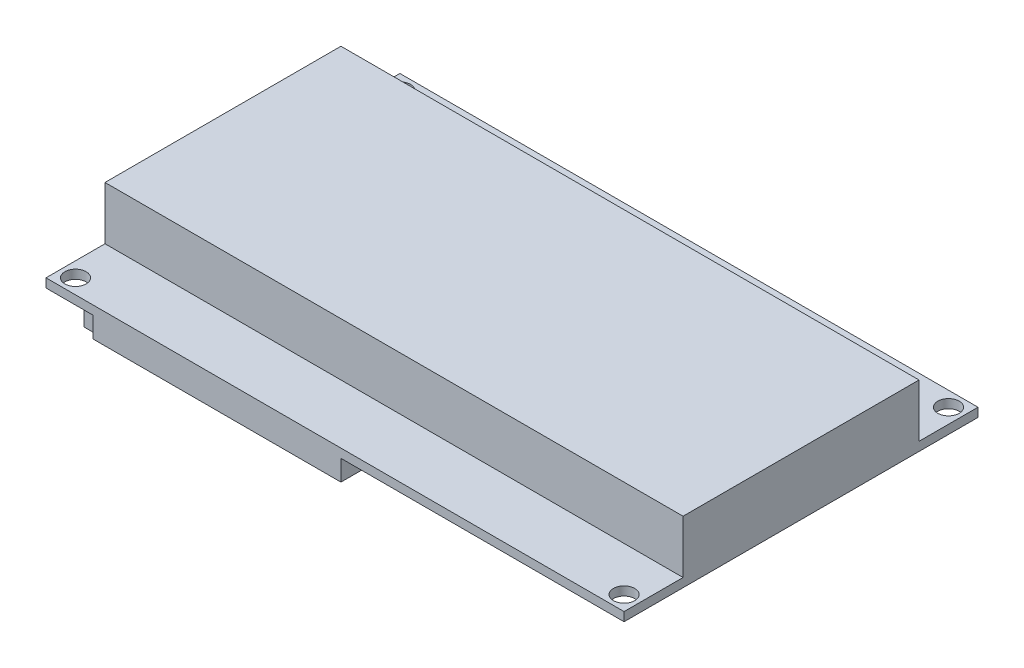
ISO-10303-21;
HEADER;
FILE_DESCRIPTION(('STEP AP214'),'2;1');
FILE_NAME('part.step','',(''),(''),'','','');
FILE_SCHEMA(('AUTOMOTIVE_DESIGN { 1 0 10303 214 1 1 1 1 }'));
ENDSEC;
DATA;
#1=APPLICATION_CONTEXT('core data for automotive mechanical design processes');
#2=APPLICATION_PROTOCOL_DEFINITION('international standard','automotive_design',2000,#1);
#3=PRODUCT_CONTEXT('',#1,'mechanical');
#4=PRODUCT('Part','Part','',(#3));
#5=PRODUCT_RELATED_PRODUCT_CATEGORY('part','',(#4));
#6=PRODUCT_DEFINITION_FORMATION('','',#4);
#7=PRODUCT_DEFINITION_CONTEXT('part definition',#1,'design');
#8=PRODUCT_DEFINITION('design','',#6,#7);
#9=PRODUCT_DEFINITION_SHAPE('','',#8);
#10=(LENGTH_UNIT() NAMED_UNIT(*) SI_UNIT(.MILLI.,.METRE.));
#11=(NAMED_UNIT(*) PLANE_ANGLE_UNIT() SI_UNIT($,.RADIAN.));
#12=(NAMED_UNIT(*) SI_UNIT($,.STERADIAN.) SOLID_ANGLE_UNIT());
#13=UNCERTAINTY_MEASURE_WITH_UNIT(LENGTH_MEASURE(1.E-05),#10,'distance_accuracy_value','');
#14=(GEOMETRIC_REPRESENTATION_CONTEXT(3) GLOBAL_UNCERTAINTY_ASSIGNED_CONTEXT((#13)) GLOBAL_UNIT_ASSIGNED_CONTEXT((#10,
#11,#12)) REPRESENTATION_CONTEXT('',''));
#15=CARTESIAN_POINT('',(0.,0.,0.));
#16=DIRECTION('',(0.,0.,1.));
#17=DIRECTION('',(1.,0.,0.));
#18=AXIS2_PLACEMENT_3D('',#15,#16,#17);
#19=CARTESIAN_POINT('',(0.,-3.5,0.));
#20=DIRECTION('',(0.,-1.,0.));
#21=DIRECTION('',(0.,0.,-1.));
#22=AXIS2_PLACEMENT_3D('',#19,#20,#21);
#23=PLANE('',#22);
#24=DIRECTION('',(1.,0.,0.));
#25=VECTOR('',#24,1.);
#26=CARTESIAN_POINT('',(-31.1622903908173,-3.5,12.3796659761304));
#27=LINE('',#26,#25);
#28=CARTESIAN_POINT('',(-31.1622903908173,-3.5,12.3796659761304));
#29=VERTEX_POINT('',#28);
#30=CARTESIAN_POINT('',(-25.9601784616069,-3.5,12.3796659761304));
#31=VERTEX_POINT('',#30);
#32=EDGE_CURVE('E314',#29,#31,#27,.T.);
#33=ORIENTED_EDGE('',*,*,#32,.F.);
#34=DIRECTION('',(0.,0.,-1.));
#35=VECTOR('',#34,1.);
#36=CARTESIAN_POINT('',(-31.1622903908173,-3.5,17.7206240939256));
#37=LINE('',#36,#35);
#38=CARTESIAN_POINT('',(-31.1622903908173,-3.5,17.7206240939256));
#39=VERTEX_POINT('',#38);
#40=EDGE_CURVE('E300',#39,#29,#37,.T.);
#41=ORIENTED_EDGE('',*,*,#40,.F.);
#42=DIRECTION('',(-1.,0.,0.));
#43=VECTOR('',#42,1.);
#44=CARTESIAN_POINT('',(-31.1622903908173,-3.5,17.7206240939256));
#45=LINE('',#44,#43);
#46=CARTESIAN_POINT('',(-25.9601784616069,-3.5,17.7206240939256));
#47=VERTEX_POINT('',#46);
#48=EDGE_CURVE('E305',#47,#39,#45,.T.);
#49=ORIENTED_EDGE('',*,*,#48,.F.);
#50=DIRECTION('',(0.,0.,1.));
#51=VECTOR('',#50,1.);
#52=CARTESIAN_POINT('',(-25.9601784616069,-3.5,17.7206240939256));
#53=LINE('',#52,#51);
#54=EDGE_CURVE('E316',#31,#47,#53,.T.);
#55=ORIENTED_EDGE('',*,*,#54,.F.);
#56=EDGE_LOOP('',(#33,#41,#49,#55));
#57=FACE_BOUND('',#56,.T.);
#58=DIRECTION('',(-1.,0.,0.));
#59=VECTOR('',#58,1.);
#60=CARTESIAN_POINT('',(-14.9200792291282,-3.5,24.751400220321));
#61=LINE('',#60,#59);
#62=CARTESIAN_POINT('',(-14.9200792291282,-3.5,24.751400220321));
#63=VERTEX_POINT('',#62);
#64=CARTESIAN_POINT('',(-20.8123605335331,-3.5,24.751400220321));
#65=VERTEX_POINT('',#64);
#66=EDGE_CURVE('E269',#63,#65,#61,.T.);
#67=ORIENTED_EDGE('',*,*,#66,.F.);
#68=DIRECTION('',(0.,0.,1.));
#69=VECTOR('',#68,1.);
#70=CARTESIAN_POINT('',(-14.9200792291282,-3.5,14.848599779679));
#71=LINE('',#70,#69);
#72=CARTESIAN_POINT('',(-14.9200792291282,-3.5,14.848599779679));
#73=VERTEX_POINT('',#72);
#74=EDGE_CURVE('E266',#73,#63,#71,.T.);
#75=ORIENTED_EDGE('',*,*,#74,.F.);
#76=DIRECTION('',(1.,0.,0.));
#77=VECTOR('',#76,1.);
#78=CARTESIAN_POINT('',(-14.9200792291282,-3.5,14.848599779679));
#79=LINE('',#78,#77);
#80=CARTESIAN_POINT('',(-20.8123605335331,-3.5,14.848599779679));
#81=VERTEX_POINT('',#80);
#82=EDGE_CURVE('E279',#81,#73,#79,.T.);
#83=ORIENTED_EDGE('',*,*,#82,.F.);
#84=DIRECTION('',(0.,0.,-1.));
#85=VECTOR('',#84,1.);
#86=CARTESIAN_POINT('',(-20.8123605335331,-3.5,14.848599779679));
#87=LINE('',#86,#85);
#88=EDGE_CURVE('E287',#65,#81,#87,.T.);
#89=ORIENTED_EDGE('',*,*,#88,.F.);
#90=EDGE_LOOP('',(#67,#75,#83,#89));
#91=FACE_BOUND('',#90,.T.);
#92=DIRECTION('',(0.,0.,1.));
#93=VECTOR('',#92,1.);
#94=CARTESIAN_POINT('',(1.,-3.5,30.));
#95=LINE('',#94,#93);
#96=CARTESIAN_POINT('',(1.,-3.5,9.59999999999999));
#97=VERTEX_POINT('',#96);
#98=CARTESIAN_POINT('',(1.,-3.5,15.));
#99=VERTEX_POINT('',#98);
#100=EDGE_CURVE('E368',#97,#99,#95,.T.);
#101=ORIENTED_EDGE('',*,*,#100,.T.);
#102=DIRECTION('',(1.,0.,0.));
#103=VECTOR('',#102,1.);
#104=CARTESIAN_POINT('',(-1.5,-3.5,15.));
#105=LINE('',#104,#103);
#106=CARTESIAN_POINT('',(-1.5,-3.5,15.));
#107=VERTEX_POINT('',#106);
#108=EDGE_CURVE('E59',#107,#99,#105,.T.);
#109=ORIENTED_EDGE('',*,*,#108,.F.);
#110=DIRECTION('',(0.,0.,-1.));
#111=VECTOR('',#110,1.);
#112=CARTESIAN_POINT('',(-1.5,-3.5,19.8));
#113=LINE('',#112,#111);
#114=CARTESIAN_POINT('',(-1.5,-3.5,19.8));
#115=VERTEX_POINT('',#114);
#116=EDGE_CURVE('E64',#115,#107,#113,.T.);
#117=ORIENTED_EDGE('',*,*,#116,.F.);
#118=DIRECTION('',(-1.,0.,0.));
#119=VECTOR('',#118,1.);
#120=CARTESIAN_POINT('',(-1.5,-3.5,19.8));
#121=LINE('',#120,#119);
#122=CARTESIAN_POINT('',(1.,-3.5,19.8));
#123=VERTEX_POINT('',#122);
#124=EDGE_CURVE('E535',#123,#115,#121,.T.);
#125=ORIENTED_EDGE('',*,*,#124,.F.);
#126=CARTESIAN_POINT('',(1.,-3.5,30.));
#127=VERTEX_POINT('',#126);
#128=EDGE_CURVE('E367',#123,#127,#95,.T.);
#129=ORIENTED_EDGE('',*,*,#128,.T.);
#130=DIRECTION('',(-1.,0.,0.));
#131=VECTOR('',#130,1.);
#132=CARTESIAN_POINT('',(-41.,-3.5,30.));
#133=LINE('',#132,#131);
#134=CARTESIAN_POINT('',(-41.,-3.5,30.));
#135=VERTEX_POINT('',#134);
#136=EDGE_CURVE('E370',#127,#135,#133,.T.);
#137=ORIENTED_EDGE('',*,*,#136,.T.);
#138=DIRECTION('',(0.,0.,-1.));
#139=VECTOR('',#138,1.);
#140=CARTESIAN_POINT('',(-41.,-3.5,30.));
#141=LINE('',#140,#139);
#142=CARTESIAN_POINT('',(-41.,-3.5,24.8));
#143=VERTEX_POINT('',#142);
#144=EDGE_CURVE('E361',#135,#143,#141,.T.);
#145=ORIENTED_EDGE('',*,*,#144,.T.);
#146=DIRECTION('',(-1.,0.,0.));
#147=VECTOR('',#146,1.);
#148=CARTESIAN_POINT('',(-38.5,-3.5,24.8));
#149=LINE('',#148,#147);
#150=CARTESIAN_POINT('',(-38.5,-3.5,24.8));
#151=VERTEX_POINT('',#150);
#152=EDGE_CURVE('E343',#151,#143,#149,.T.);
#153=ORIENTED_EDGE('',*,*,#152,.F.);
#154=DIRECTION('',(0.,0.,1.));
#155=VECTOR('',#154,1.);
#156=CARTESIAN_POINT('',(-38.5,-3.5,24.8));
#157=LINE('',#156,#155);
#158=CARTESIAN_POINT('',(-38.5,-3.5,14.8));
#159=VERTEX_POINT('',#158);
#160=EDGE_CURVE('E329',#159,#151,#157,.T.);
#161=ORIENTED_EDGE('',*,*,#160,.F.);
#162=DIRECTION('',(1.,0.,0.));
#163=VECTOR('',#162,1.);
#164=CARTESIAN_POINT('',(-38.5,-3.5,14.8));
#165=LINE('',#164,#163);
#166=CARTESIAN_POINT('',(-41.,-3.5,14.8));
#167=VERTEX_POINT('',#166);
#168=EDGE_CURVE('E11',#167,#159,#165,.T.);
#169=ORIENTED_EDGE('',*,*,#168,.F.);
#170=CARTESIAN_POINT('',(-41.,-3.5,9.59999999999999));
#171=VERTEX_POINT('',#170);
#172=EDGE_CURVE('E365',#167,#171,#141,.T.);
#173=ORIENTED_EDGE('',*,*,#172,.T.);
#174=DIRECTION('',(1.,0.,0.));
#175=VECTOR('',#174,1.);
#176=CARTESIAN_POINT('',(-41.,-3.5,9.59999999999999));
#177=LINE('',#176,#175);
#178=EDGE_CURVE('E363',#171,#97,#177,.T.);
#179=ORIENTED_EDGE('',*,*,#178,.T.);
#180=EDGE_LOOP('',(#101,#109,#117,#125,#129,#137,#145,#153,#161,#169,#173,#179));
#181=FACE_BOUND('',#180,.T.);
#182=ADVANCED_FACE('F42',(#57,#91,#181),#23,.T.);
#183=CARTESIAN_POINT('',(0.,1.5,0.));
#184=DIRECTION('',(0.,-1.,0.));
#185=DIRECTION('',(0.,0.,-1.));
#186=AXIS2_PLACEMENT_3D('',#183,#184,#185);
#187=PLANE('',#186);
#188=CARTESIAN_POINT('',(-46.5,1.5,27.5));
#189=DIRECTION('',(0.,-1.,0.));
#190=DIRECTION('',(0.,0.,-1.));
#191=AXIS2_PLACEMENT_3D('',#188,#189,#190);
#192=CIRCLE('',#191,1.8);
#193=CARTESIAN_POINT('',(-46.5,1.5,25.7));
#194=VERTEX_POINT('',#193);
#195=EDGE_CURVE('E465',#194,#194,#192,.T.);
#196=ORIENTED_EDGE('',*,*,#195,.T.);
#197=EDGE_LOOP('',(#196));
#198=FACE_BOUND('',#197,.T.);
#199=DIRECTION('',(1.,0.,0.));
#200=VECTOR('',#199,1.);
#201=CARTESIAN_POINT('',(0.,1.5,20.));
#202=LINE('',#201,#200);
#203=CARTESIAN_POINT('',(-49.,1.5,20.));
#204=VERTEX_POINT('',#203);
#205=CARTESIAN_POINT('',(49.,1.5,20.));
#206=VERTEX_POINT('',#205);
#207=EDGE_CURVE('E468',#204,#206,#202,.T.);
#208=ORIENTED_EDGE('',*,*,#207,.F.);
#209=DIRECTION('',(0.,0.,1.));
#210=VECTOR('',#209,1.);
#211=CARTESIAN_POINT('',(-49.,1.5,0.));
#212=LINE('',#211,#210);
#213=CARTESIAN_POINT('',(-49.,1.5,30.));
#214=VERTEX_POINT('',#213);
#215=EDGE_CURVE('E478',#204,#214,#212,.T.);
#216=ORIENTED_EDGE('',*,*,#215,.T.);
#217=DIRECTION('',(1.,0.,0.));
#218=VECTOR('',#217,1.);
#219=CARTESIAN_POINT('',(0.,1.5,30.));
#220=LINE('',#219,#218);
#221=CARTESIAN_POINT('',(49.,1.5,30.));
#222=VERTEX_POINT('',#221);
#223=EDGE_CURVE('E480',#214,#222,#220,.T.);
#224=ORIENTED_EDGE('',*,*,#223,.T.);
#225=DIRECTION('',(0.,0.,1.));
#226=VECTOR('',#225,1.);
#227=CARTESIAN_POINT('',(49.,1.5,0.));
#228=LINE('',#227,#226);
#229=EDGE_CURVE('E454',#206,#222,#228,.T.);
#230=ORIENTED_EDGE('',*,*,#229,.F.);
#231=EDGE_LOOP('',(#208,#216,#224,#230));
#232=FACE_BOUND('',#231,.T.);
#233=CARTESIAN_POINT('',(46.5,1.5,27.5));
#234=DIRECTION('',(0.,1.,0.));
#235=DIRECTION('',(0.,0.,-1.));
#236=AXIS2_PLACEMENT_3D('',#233,#234,#235);
#237=CIRCLE('',#236,1.8);
#238=CARTESIAN_POINT('',(46.5,1.5,25.7));
#239=VERTEX_POINT('',#238);
#240=EDGE_CURVE('E444',#239,#239,#237,.T.);
#241=ORIENTED_EDGE('',*,*,#240,.F.);
#242=EDGE_LOOP('',(#241));
#243=FACE_BOUND('',#242,.T.);
#244=ADVANCED_FACE('F526',(#198,#232,#243),#187,.F.);
#245=CARTESIAN_POINT('',(-49.,1.5,0.));
#246=DIRECTION('',(1.,0.,0.));
#247=DIRECTION('',(0.,0.,-1.));
#248=AXIS2_PLACEMENT_3D('',#245,#246,#247);
#249=PLANE('',#248);
#250=DIRECTION('',(0.,0.,1.));
#251=VECTOR('',#250,1.);
#252=CARTESIAN_POINT('',(-49.,0.,0.));
#253=LINE('',#252,#251);
#254=CARTESIAN_POINT('',(-49.,0.,-30.));
#255=VERTEX_POINT('',#254);
#256=CARTESIAN_POINT('',(-49.,0.,30.));
#257=VERTEX_POINT('',#256);
#258=EDGE_CURVE('E477',#255,#257,#253,.T.);
#259=ORIENTED_EDGE('',*,*,#258,.T.);
#260=DIRECTION('',(0.,-1.,0.));
#261=VECTOR('',#260,1.);
#262=CARTESIAN_POINT('',(-49.,1.5,30.));
#263=LINE('',#262,#261);
#264=EDGE_CURVE('E46',#214,#257,#263,.T.);
#265=ORIENTED_EDGE('',*,*,#264,.F.);
#266=ORIENTED_EDGE('',*,*,#215,.F.);
#267=DIRECTION('',(0.,-1.,0.));
#268=VECTOR('',#267,1.);
#269=CARTESIAN_POINT('',(-49.,10.5,20.));
#270=LINE('',#269,#268);
#271=CARTESIAN_POINT('',(-49.,10.5,20.));
#272=VERTEX_POINT('',#271);
#273=EDGE_CURVE('E473',#272,#204,#270,.T.);
#274=ORIENTED_EDGE('',*,*,#273,.F.);
#275=DIRECTION('',(0.,0.,1.));
#276=VECTOR('',#275,1.);
#277=CARTESIAN_POINT('',(-49.,10.5,0.));
#278=LINE('',#277,#276);
#279=CARTESIAN_POINT('',(-49.,10.5,-20.));
#280=VERTEX_POINT('',#279);
#281=EDGE_CURVE('E469',#280,#272,#278,.T.);
#282=ORIENTED_EDGE('',*,*,#281,.F.);
#283=DIRECTION('',(0.,-1.,0.));
#284=VECTOR('',#283,1.);
#285=CARTESIAN_POINT('',(-49.,10.5,-20.));
#286=LINE('',#285,#284);
#287=CARTESIAN_POINT('',(-49.,1.5,-20.));
#288=VERTEX_POINT('',#287);
#289=EDGE_CURVE('E419',#280,#288,#286,.T.);
#290=ORIENTED_EDGE('',*,*,#289,.T.);
#291=DIRECTION('',(0.,0.,-1.));
#292=VECTOR('',#291,1.);
#293=CARTESIAN_POINT('',(-49.,1.5,0.));
#294=LINE('',#293,#292);
#295=CARTESIAN_POINT('',(-49.,1.5,-30.));
#296=VERTEX_POINT('',#295);
#297=EDGE_CURVE('E426',#288,#296,#294,.T.);
#298=ORIENTED_EDGE('',*,*,#297,.T.);
#299=DIRECTION('',(0.,-1.,0.));
#300=VECTOR('',#299,1.);
#301=CARTESIAN_POINT('',(-49.,1.5,-30.));
#302=LINE('',#301,#300);
#303=EDGE_CURVE('E434',#296,#255,#302,.T.);
#304=ORIENTED_EDGE('',*,*,#303,.T.);
#305=EDGE_LOOP('',(#259,#265,#266,#274,#282,#290,#298,#304));
#306=FACE_BOUND('',#305,.T.);
#307=ADVANCED_FACE('F44',(#306),#249,.F.);
#308=CARTESIAN_POINT('',(0.,1.5,30.));
#309=DIRECTION('',(0.,0.,-1.));
#310=DIRECTION('',(-1.,0.,0.));
#311=AXIS2_PLACEMENT_3D('',#308,#309,#310);
#312=PLANE('',#311);
#313=DIRECTION('',(1.,0.,0.));
#314=VECTOR('',#313,1.);
#315=CARTESIAN_POINT('',(0.,0.,30.));
#316=LINE('',#315,#314);
#317=CARTESIAN_POINT('',(-41.,0.,30.));
#318=VERTEX_POINT('',#317);
#319=EDGE_CURVE('E481',#257,#318,#316,.T.);
#320=ORIENTED_EDGE('',*,*,#319,.T.);
#321=DIRECTION('',(0.,1.,0.));
#322=VECTOR('',#321,1.);
#323=CARTESIAN_POINT('',(-41.,-3.5,30.));
#324=LINE('',#323,#322);
#325=EDGE_CURVE('E373',#135,#318,#324,.T.);
#326=ORIENTED_EDGE('',*,*,#325,.F.);
#327=ORIENTED_EDGE('',*,*,#136,.F.);
#328=DIRECTION('',(0.,1.,0.));
#329=VECTOR('',#328,1.);
#330=CARTESIAN_POINT('',(1.,-3.5,30.));
#331=LINE('',#330,#329);
#332=CARTESIAN_POINT('',(1.,0.,30.));
#333=VERTEX_POINT('',#332);
#334=EDGE_CURVE('E384',#127,#333,#331,.T.);
#335=ORIENTED_EDGE('',*,*,#334,.T.);
#336=CARTESIAN_POINT('',(49.,0.,30.));
#337=VERTEX_POINT('',#336);
#338=EDGE_CURVE('E484',#333,#337,#316,.T.);
#339=ORIENTED_EDGE('',*,*,#338,.T.);
#340=DIRECTION('',(0.,-1.,0.));
#341=VECTOR('',#340,1.);
#342=CARTESIAN_POINT('',(49.,1.5,30.));
#343=LINE('',#342,#341);
#344=EDGE_CURVE('E457',#222,#337,#343,.T.);
#345=ORIENTED_EDGE('',*,*,#344,.F.);
#346=ORIENTED_EDGE('',*,*,#223,.F.);
#347=ORIENTED_EDGE('',*,*,#264,.T.);
#348=EDGE_LOOP('',(#320,#326,#327,#335,#339,#345,#346,#347));
#349=FACE_BOUND('',#348,.T.);
#350=ADVANCED_FACE('F491',(#349),#312,.F.);
#351=CARTESIAN_POINT('',(0.,0.,0.));
#352=DIRECTION('',(0.,-1.,0.));
#353=DIRECTION('',(0.,0.,-1.));
#354=AXIS2_PLACEMENT_3D('',#351,#352,#353);
#355=PLANE('',#354);
#356=DIRECTION('',(0.,0.,-1.));
#357=VECTOR('',#356,1.);
#358=CARTESIAN_POINT('',(-41.,0.,30.));
#359=LINE('',#358,#357);
#360=CARTESIAN_POINT('',(-41.,0.,9.59999999999999));
#361=VERTEX_POINT('',#360);
#362=EDGE_CURVE('E360',#318,#361,#359,.T.);
#363=ORIENTED_EDGE('',*,*,#362,.F.);
#364=ORIENTED_EDGE('',*,*,#319,.F.);
#365=ORIENTED_EDGE('',*,*,#258,.F.);
#366=DIRECTION('',(1.,0.,0.));
#367=VECTOR('',#366,1.);
#368=CARTESIAN_POINT('',(0.,0.,-30.));
#369=LINE('',#368,#367);
#370=CARTESIAN_POINT('',(49.,0.,-30.));
#371=VERTEX_POINT('',#370);
#372=EDGE_CURVE('E425',#255,#371,#369,.T.);
#373=ORIENTED_EDGE('',*,*,#372,.T.);
#374=DIRECTION('',(0.,0.,1.));
#375=VECTOR('',#374,1.);
#376=CARTESIAN_POINT('',(49.,0.,0.));
#377=LINE('',#376,#375);
#378=EDGE_CURVE('E453',#371,#337,#377,.T.);
#379=ORIENTED_EDGE('',*,*,#378,.T.);
#380=ORIENTED_EDGE('',*,*,#338,.F.);
#381=DIRECTION('',(0.,0.,1.));
#382=VECTOR('',#381,1.);
#383=CARTESIAN_POINT('',(1.,0.,30.));
#384=LINE('',#383,#382);
#385=CARTESIAN_POINT('',(1.,0.,9.59999999999999));
#386=VERTEX_POINT('',#385);
#387=EDGE_CURVE('E379',#386,#333,#384,.T.);
#388=ORIENTED_EDGE('',*,*,#387,.F.);
#389=DIRECTION('',(1.,0.,0.));
#390=VECTOR('',#389,1.);
#391=CARTESIAN_POINT('',(-41.,0.,9.59999999999999));
#392=LINE('',#391,#390);
#393=EDGE_CURVE('E376',#361,#386,#392,.T.);
#394=ORIENTED_EDGE('',*,*,#393,.F.);
#395=EDGE_LOOP('',(#363,#364,#365,#373,#379,#380,#388,#394));
#396=FACE_BOUND('',#395,.T.);
#397=CARTESIAN_POINT('',(-46.5,0.,27.5));
#398=DIRECTION('',(0.,1.,0.));
#399=DIRECTION('',(0.,0.,1.));
#400=AXIS2_PLACEMENT_3D('',#397,#398,#399);
#401=CIRCLE('',#400,1.8);
#402=CARTESIAN_POINT('',(-46.5,0.,29.3));
#403=VERTEX_POINT('',#402);
#404=EDGE_CURVE('E462',#403,#403,#401,.T.);
#405=ORIENTED_EDGE('',*,*,#404,.T.);
#406=EDGE_LOOP('',(#405));
#407=FACE_BOUND('',#406,.T.);
#408=CARTESIAN_POINT('',(46.5,0.,27.5));
#409=DIRECTION('',(0.,-1.,0.));
#410=DIRECTION('',(0.,0.,1.));
#411=AXIS2_PLACEMENT_3D('',#408,#409,#410);
#412=CIRCLE('',#411,1.8);
#413=CARTESIAN_POINT('',(46.5,0.,29.3));
#414=VERTEX_POINT('',#413);
#415=EDGE_CURVE('E441',#414,#414,#412,.T.);
#416=ORIENTED_EDGE('',*,*,#415,.F.);
#417=EDGE_LOOP('',(#416));
#418=FACE_BOUND('',#417,.T.);
#419=CARTESIAN_POINT('',(-46.5,0.,-27.5));
#420=DIRECTION('',(0.,-1.,0.));
#421=DIRECTION('',(0.,0.,-1.));
#422=AXIS2_PLACEMENT_3D('',#419,#420,#421);
#423=CIRCLE('',#422,1.8);
#424=CARTESIAN_POINT('',(-46.5,0.,-29.3));
#425=VERTEX_POINT('',#424);
#426=EDGE_CURVE('E407',#425,#425,#423,.T.);
#427=ORIENTED_EDGE('',*,*,#426,.F.);
#428=EDGE_LOOP('',(#427));
#429=FACE_BOUND('',#428,.T.);
#430=CARTESIAN_POINT('',(46.5,0.,-27.5));
#431=DIRECTION('',(0.,1.,0.));
#432=DIRECTION('',(0.,0.,-1.));
#433=AXIS2_PLACEMENT_3D('',#430,#431,#432);
#434=CIRCLE('',#433,1.8);
#435=CARTESIAN_POINT('',(46.5,0.,-29.3));
#436=VERTEX_POINT('',#435);
#437=EDGE_CURVE('E393',#436,#436,#434,.T.);
#438=ORIENTED_EDGE('',*,*,#437,.T.);
#439=EDGE_LOOP('',(#438));
#440=FACE_BOUND('',#439,.T.);
#441=ADVANCED_FACE('F499',(#396,#407,#418,#429,#440),#355,.T.);
#442=CARTESIAN_POINT('',(0.,10.5,20.));
#443=DIRECTION('',(0.,0.,-1.));
#444=DIRECTION('',(-1.,0.,0.));
#445=AXIS2_PLACEMENT_3D('',#442,#443,#444);
#446=PLANE('',#445);
#447=ORIENTED_EDGE('',*,*,#207,.T.);
#448=DIRECTION('',(0.,-1.,0.));
#449=VECTOR('',#448,1.);
#450=CARTESIAN_POINT('',(49.,10.5,20.));
#451=LINE('',#450,#449);
#452=CARTESIAN_POINT('',(49.,10.5,20.));
#453=VERTEX_POINT('',#452);
#454=EDGE_CURVE('E450',#453,#206,#451,.T.);
#455=ORIENTED_EDGE('',*,*,#454,.F.);
#456=DIRECTION('',(1.,0.,0.));
#457=VECTOR('',#456,1.);
#458=CARTESIAN_POINT('',(0.,10.5,20.));
#459=LINE('',#458,#457);
#460=EDGE_CURVE('E471',#272,#453,#459,.T.);
#461=ORIENTED_EDGE('',*,*,#460,.F.);
#462=ORIENTED_EDGE('',*,*,#273,.T.);
#463=EDGE_LOOP('',(#447,#455,#461,#462));
#464=FACE_BOUND('',#463,.T.);
#465=ADVANCED_FACE('F524',(#464),#446,.F.);
#466=CARTESIAN_POINT('',(0.,10.5,0.));
#467=DIRECTION('',(0.,-1.,0.));
#468=DIRECTION('',(0.,0.,-1.));
#469=AXIS2_PLACEMENT_3D('',#466,#467,#468);
#470=PLANE('',#469);
#471=ORIENTED_EDGE('',*,*,#460,.T.);
#472=DIRECTION('',(0.,0.,1.));
#473=VECTOR('',#472,1.);
#474=CARTESIAN_POINT('',(49.,10.5,0.));
#475=LINE('',#474,#473);
#476=CARTESIAN_POINT('',(49.,10.5,-20.));
#477=VERTEX_POINT('',#476);
#478=EDGE_CURVE('E447',#477,#453,#475,.T.);
#479=ORIENTED_EDGE('',*,*,#478,.F.);
#480=DIRECTION('',(1.,0.,0.));
#481=VECTOR('',#480,1.);
#482=CARTESIAN_POINT('',(0.,10.5,-20.));
#483=LINE('',#482,#481);
#484=EDGE_CURVE('E416',#280,#477,#483,.T.);
#485=ORIENTED_EDGE('',*,*,#484,.F.);
#486=ORIENTED_EDGE('',*,*,#281,.T.);
#487=EDGE_LOOP('',(#471,#479,#485,#486));
#488=FACE_BOUND('',#487,.T.);
#489=ADVANCED_FACE('F519',(#488),#470,.F.);
#490=CARTESIAN_POINT('',(-46.5,0.,27.5));
#491=DIRECTION('',(0.,1.,0.));
#492=DIRECTION('',(0.,0.,1.));
#493=AXIS2_PLACEMENT_3D('',#490,#491,#492);
#494=CYLINDRICAL_SURFACE('',#493,1.8);
#495=ORIENTED_EDGE('',*,*,#404,.F.);
#496=EDGE_LOOP('',(#495));
#497=FACE_BOUND('',#496,.T.);
#498=ORIENTED_EDGE('',*,*,#195,.F.);
#499=EDGE_LOOP('',(#498));
#500=FACE_BOUND('',#499,.T.);
#501=ADVANCED_FACE('F618',(#497,#500),#494,.F.);
#502=CARTESIAN_POINT('',(49.,1.5,0.));
#503=DIRECTION('',(-1.,0.,0.));
#504=DIRECTION('',(0.,0.,-1.));
#505=AXIS2_PLACEMENT_3D('',#502,#503,#504);
#506=PLANE('',#505);
#507=ORIENTED_EDGE('',*,*,#378,.F.);
#508=DIRECTION('',(0.,-1.,0.));
#509=VECTOR('',#508,1.);
#510=CARTESIAN_POINT('',(49.,1.5,-30.));
#511=LINE('',#510,#509);
#512=CARTESIAN_POINT('',(49.,1.5,-30.));
#513=VERTEX_POINT('',#512);
#514=EDGE_CURVE('E404',#513,#371,#511,.T.);
#515=ORIENTED_EDGE('',*,*,#514,.F.);
#516=DIRECTION('',(0.,0.,-1.));
#517=VECTOR('',#516,1.);
#518=CARTESIAN_POINT('',(49.,1.5,0.));
#519=LINE('',#518,#517);
#520=CARTESIAN_POINT('',(49.,1.5,-20.));
#521=VERTEX_POINT('',#520);
#522=EDGE_CURVE('E401',#521,#513,#519,.T.);
#523=ORIENTED_EDGE('',*,*,#522,.F.);
#524=DIRECTION('',(0.,-1.,0.));
#525=VECTOR('',#524,1.);
#526=CARTESIAN_POINT('',(49.,10.5,-20.));
#527=LINE('',#526,#525);
#528=EDGE_CURVE('E399',#477,#521,#527,.T.);
#529=ORIENTED_EDGE('',*,*,#528,.F.);
#530=ORIENTED_EDGE('',*,*,#478,.T.);
#531=ORIENTED_EDGE('',*,*,#454,.T.);
#532=ORIENTED_EDGE('',*,*,#229,.T.);
#533=ORIENTED_EDGE('',*,*,#344,.T.);
#534=EDGE_LOOP('',(#507,#515,#523,#529,#530,#531,#532,#533));
#535=FACE_BOUND('',#534,.T.);
#536=ADVANCED_FACE('F497',(#535),#506,.F.);
#537=CARTESIAN_POINT('',(46.5,0.,27.5));
#538=DIRECTION('',(0.,1.,0.));
#539=DIRECTION('',(0.,0.,1.));
#540=AXIS2_PLACEMENT_3D('',#537,#538,#539);
#541=CYLINDRICAL_SURFACE('',#540,1.8);
#542=ORIENTED_EDGE('',*,*,#415,.T.);
#543=EDGE_LOOP('',(#542));
#544=FACE_BOUND('',#543,.T.);
#545=ORIENTED_EDGE('',*,*,#240,.T.);
#546=EDGE_LOOP('',(#545));
#547=FACE_BOUND('',#546,.T.);
#548=ADVANCED_FACE('F609',(#544,#547),#541,.F.);
#549=CARTESIAN_POINT('',(0.,1.5,0.));
#550=DIRECTION('',(0.,-1.,0.));
#551=DIRECTION('',(0.,0.,1.));
#552=AXIS2_PLACEMENT_3D('',#549,#550,#551);
#553=PLANE('',#552);
#554=CARTESIAN_POINT('',(-46.5,1.5,-27.5));
#555=DIRECTION('',(0.,1.,0.));
#556=DIRECTION('',(0.,0.,1.));
#557=AXIS2_PLACEMENT_3D('',#554,#555,#556);
#558=CIRCLE('',#557,1.8);
#559=CARTESIAN_POINT('',(-46.5,1.5,-25.7));
#560=VERTEX_POINT('',#559);
#561=EDGE_CURVE('E411',#560,#560,#558,.T.);
#562=ORIENTED_EDGE('',*,*,#561,.F.);
#563=EDGE_LOOP('',(#562));
#564=FACE_BOUND('',#563,.T.);
#565=DIRECTION('',(1.,0.,0.));
#566=VECTOR('',#565,1.);
#567=CARTESIAN_POINT('',(0.,1.5,-20.));
#568=LINE('',#567,#566);
#569=EDGE_CURVE('E415',#288,#521,#568,.T.);
#570=ORIENTED_EDGE('',*,*,#569,.T.);
#571=ORIENTED_EDGE('',*,*,#522,.T.);
#572=DIRECTION('',(1.,0.,0.));
#573=VECTOR('',#572,1.);
#574=CARTESIAN_POINT('',(0.,1.5,-30.));
#575=LINE('',#574,#573);
#576=EDGE_CURVE('E430',#296,#513,#575,.T.);
#577=ORIENTED_EDGE('',*,*,#576,.F.);
#578=ORIENTED_EDGE('',*,*,#297,.F.);
#579=EDGE_LOOP('',(#570,#571,#577,#578));
#580=FACE_BOUND('',#579,.T.);
#581=CARTESIAN_POINT('',(46.5,1.5,-27.5));
#582=DIRECTION('',(0.,-1.,0.));
#583=DIRECTION('',(0.,0.,1.));
#584=AXIS2_PLACEMENT_3D('',#581,#582,#583);
#585=CIRCLE('',#584,1.8);
#586=CARTESIAN_POINT('',(46.5,1.5,-25.7));
#587=VERTEX_POINT('',#586);
#588=EDGE_CURVE('E396',#587,#587,#585,.T.);
#589=ORIENTED_EDGE('',*,*,#588,.T.);
#590=EDGE_LOOP('',(#589));
#591=FACE_BOUND('',#590,.T.);
#592=ADVANCED_FACE('F511',(#564,#580,#591),#553,.F.);
#593=CARTESIAN_POINT('',(0.,1.5,-30.));
#594=DIRECTION('',(0.,0.,1.));
#595=DIRECTION('',(-1.,0.,0.));
#596=AXIS2_PLACEMENT_3D('',#593,#594,#595);
#597=PLANE('',#596);
#598=ORIENTED_EDGE('',*,*,#372,.F.);
#599=ORIENTED_EDGE('',*,*,#303,.F.);
#600=ORIENTED_EDGE('',*,*,#576,.T.);
#601=ORIENTED_EDGE('',*,*,#514,.T.);
#602=EDGE_LOOP('',(#598,#599,#600,#601));
#603=FACE_BOUND('',#602,.T.);
#604=ADVANCED_FACE('F503',(#603),#597,.F.);
#605=CARTESIAN_POINT('',(0.,10.5,-20.));
#606=DIRECTION('',(0.,0.,1.));
#607=DIRECTION('',(-1.,0.,0.));
#608=AXIS2_PLACEMENT_3D('',#605,#606,#607);
#609=PLANE('',#608);
#610=ORIENTED_EDGE('',*,*,#569,.F.);
#611=ORIENTED_EDGE('',*,*,#289,.F.);
#612=ORIENTED_EDGE('',*,*,#484,.T.);
#613=ORIENTED_EDGE('',*,*,#528,.T.);
#614=EDGE_LOOP('',(#610,#611,#612,#613));
#615=FACE_BOUND('',#614,.T.);
#616=ADVANCED_FACE('F517',(#615),#609,.F.);
#617=CARTESIAN_POINT('',(-46.5,0.,-27.5));
#618=DIRECTION('',(0.,1.,0.));
#619=DIRECTION('',(0.,0.,-1.));
#620=AXIS2_PLACEMENT_3D('',#617,#618,#619);
#621=CYLINDRICAL_SURFACE('',#620,1.8);
#622=ORIENTED_EDGE('',*,*,#426,.T.);
#623=EDGE_LOOP('',(#622));
#624=FACE_BOUND('',#623,.T.);
#625=ORIENTED_EDGE('',*,*,#561,.T.);
#626=EDGE_LOOP('',(#625));
#627=FACE_BOUND('',#626,.T.);
#628=ADVANCED_FACE('F600',(#624,#627),#621,.F.);
#629=CARTESIAN_POINT('',(46.5,0.,-27.5));
#630=DIRECTION('',(0.,1.,0.));
#631=DIRECTION('',(0.,0.,-1.));
#632=AXIS2_PLACEMENT_3D('',#629,#630,#631);
#633=CYLINDRICAL_SURFACE('',#632,1.8);
#634=ORIENTED_EDGE('',*,*,#437,.F.);
#635=EDGE_LOOP('',(#634));
#636=FACE_BOUND('',#635,.T.);
#637=ORIENTED_EDGE('',*,*,#588,.F.);
#638=EDGE_LOOP('',(#637));
#639=FACE_BOUND('',#638,.T.);
#640=ADVANCED_FACE('F597',(#636,#639),#633,.F.);
#641=CARTESIAN_POINT('',(-41.,-3.5,30.));
#642=DIRECTION('',(1.,0.,0.));
#643=DIRECTION('',(0.,0.,-1.));
#644=AXIS2_PLACEMENT_3D('',#641,#642,#643);
#645=PLANE('',#644);
#646=ORIENTED_EDGE('',*,*,#362,.T.);
#647=DIRECTION('',(0.,1.,0.));
#648=VECTOR('',#647,1.);
#649=CARTESIAN_POINT('',(-41.,-3.5,9.59999999999999));
#650=LINE('',#649,#648);
#651=EDGE_CURVE('E390',#171,#361,#650,.T.);
#652=ORIENTED_EDGE('',*,*,#651,.F.);
#653=ORIENTED_EDGE('',*,*,#172,.F.);
#654=EDGE_CURVE('E364',#143,#167,#141,.T.);
#655=ORIENTED_EDGE('',*,*,#654,.F.);
#656=ORIENTED_EDGE('',*,*,#144,.F.);
#657=ORIENTED_EDGE('',*,*,#325,.T.);
#658=EDGE_LOOP('',(#646,#652,#653,#655,#656,#657));
#659=FACE_BOUND('',#658,.T.);
#660=ADVANCED_FACE('F531',(#659),#645,.F.);
#661=CARTESIAN_POINT('',(-41.,-3.5,9.59999999999999));
#662=DIRECTION('',(0.,0.,1.));
#663=DIRECTION('',(1.,0.,0.));
#664=AXIS2_PLACEMENT_3D('',#661,#662,#663);
#665=PLANE('',#664);
#666=ORIENTED_EDGE('',*,*,#393,.T.);
#667=DIRECTION('',(0.,1.,0.));
#668=VECTOR('',#667,1.);
#669=CARTESIAN_POINT('',(1.,-3.5,9.59999999999999));
#670=LINE('',#669,#668);
#671=EDGE_CURVE('E387',#97,#386,#670,.T.);
#672=ORIENTED_EDGE('',*,*,#671,.F.);
#673=ORIENTED_EDGE('',*,*,#178,.F.);
#674=ORIENTED_EDGE('',*,*,#651,.T.);
#675=EDGE_LOOP('',(#666,#672,#673,#674));
#676=FACE_BOUND('',#675,.T.);
#677=ADVANCED_FACE('F542',(#676),#665,.F.);
#678=CARTESIAN_POINT('',(1.,-3.5,30.));
#679=DIRECTION('',(-1.,0.,0.));
#680=DIRECTION('',(0.,0.,1.));
#681=AXIS2_PLACEMENT_3D('',#678,#679,#680);
#682=PLANE('',#681);
#683=ORIENTED_EDGE('',*,*,#387,.T.);
#684=ORIENTED_EDGE('',*,*,#334,.F.);
#685=ORIENTED_EDGE('',*,*,#128,.F.);
#686=EDGE_CURVE('E371',#99,#123,#95,.T.);
#687=ORIENTED_EDGE('',*,*,#686,.F.);
#688=ORIENTED_EDGE('',*,*,#100,.F.);
#689=ORIENTED_EDGE('',*,*,#671,.T.);
#690=EDGE_LOOP('',(#683,#684,#685,#687,#688,#689));
#691=FACE_BOUND('',#690,.T.);
#692=ADVANCED_FACE('F538',(#691),#682,.F.);
#693=CARTESIAN_POINT('',(-38.5,-7.7,24.8));
#694=DIRECTION('',(-1.,0.,0.));
#695=DIRECTION('',(0.,0.,1.));
#696=AXIS2_PLACEMENT_3D('',#693,#694,#695);
#697=PLANE('',#696);
#698=ORIENTED_EDGE('',*,*,#160,.T.);
#699=DIRECTION('',(0.,1.,0.));
#700=VECTOR('',#699,1.);
#701=CARTESIAN_POINT('',(-38.5,-7.7,24.8));
#702=LINE('',#701,#700);
#703=CARTESIAN_POINT('',(-38.5,-7.7,24.8));
#704=VERTEX_POINT('',#703);
#705=EDGE_CURVE('E357',#704,#151,#702,.T.);
#706=ORIENTED_EDGE('',*,*,#705,.F.);
#707=DIRECTION('',(0.,0.,1.));
#708=VECTOR('',#707,1.);
#709=CARTESIAN_POINT('',(-38.5,-7.7,24.8));
#710=LINE('',#709,#708);
#711=CARTESIAN_POINT('',(-38.5,-7.7,14.8));
#712=VERTEX_POINT('',#711);
#713=EDGE_CURVE('E330',#712,#704,#710,.T.);
#714=ORIENTED_EDGE('',*,*,#713,.F.);
#715=DIRECTION('',(0.,1.,0.));
#716=VECTOR('',#715,1.);
#717=CARTESIAN_POINT('',(-38.5,-7.7,14.8));
#718=LINE('',#717,#716);
#719=EDGE_CURVE('E339',#712,#159,#718,.T.);
#720=ORIENTED_EDGE('',*,*,#719,.T.);
#721=EDGE_LOOP('',(#698,#706,#714,#720));
#722=FACE_BOUND('',#721,.T.);
#723=ADVANCED_FACE('F564',(#722),#697,.F.);
#724=CARTESIAN_POINT('',(-38.5,-7.7,24.8));
#725=DIRECTION('',(0.,0.,-1.));
#726=DIRECTION('',(-1.,0.,0.));
#727=AXIS2_PLACEMENT_3D('',#724,#725,#726);
#728=PLANE('',#727);
#729=ORIENTED_EDGE('',*,*,#152,.T.);
#730=CARTESIAN_POINT('',(-47.8,-3.5,24.8));
#731=VERTEX_POINT('',#730);
#732=EDGE_CURVE('E342',#143,#731,#149,.T.);
#733=ORIENTED_EDGE('',*,*,#732,.T.);
#734=DIRECTION('',(0.,1.,0.));
#735=VECTOR('',#734,1.);
#736=CARTESIAN_POINT('',(-47.8,-7.7,24.8));
#737=LINE('',#736,#735);
#738=CARTESIAN_POINT('',(-47.8,-7.7,24.8));
#739=VERTEX_POINT('',#738);
#740=EDGE_CURVE('E354',#739,#731,#737,.T.);
#741=ORIENTED_EDGE('',*,*,#740,.F.);
#742=DIRECTION('',(-1.,0.,0.));
#743=VECTOR('',#742,1.);
#744=CARTESIAN_POINT('',(-38.5,-7.7,24.8));
#745=LINE('',#744,#743);
#746=EDGE_CURVE('E333',#704,#739,#745,.T.);
#747=ORIENTED_EDGE('',*,*,#746,.F.);
#748=ORIENTED_EDGE('',*,*,#705,.T.);
#749=EDGE_LOOP('',(#729,#733,#741,#747,#748));
#750=FACE_BOUND('',#749,.T.);
#751=ADVANCED_FACE('F561',(#750),#728,.F.);
#752=CARTESIAN_POINT('',(-47.8,-7.7,24.8));
#753=DIRECTION('',(1.,0.,0.));
#754=DIRECTION('',(0.,0.,-1.));
#755=AXIS2_PLACEMENT_3D('',#752,#753,#754);
#756=PLANE('',#755);
#757=DIRECTION('',(0.,0.,-1.));
#758=VECTOR('',#757,1.);
#759=CARTESIAN_POINT('',(-47.8,-3.5,24.8));
#760=LINE('',#759,#758);
#761=CARTESIAN_POINT('',(-47.8,-3.5,14.8));
#762=VERTEX_POINT('',#761);
#763=EDGE_CURVE('E346',#731,#762,#760,.T.);
#764=ORIENTED_EDGE('',*,*,#763,.T.);
#765=DIRECTION('',(0.,1.,0.));
#766=VECTOR('',#765,1.);
#767=CARTESIAN_POINT('',(-47.8,-7.7,14.8));
#768=LINE('',#767,#766);
#769=CARTESIAN_POINT('',(-47.8,-7.7,14.8));
#770=VERTEX_POINT('',#769);
#771=EDGE_CURVE('E351',#770,#762,#768,.T.);
#772=ORIENTED_EDGE('',*,*,#771,.F.);
#773=DIRECTION('',(0.,0.,-1.));
#774=VECTOR('',#773,1.);
#775=CARTESIAN_POINT('',(-47.8,-7.7,24.8));
#776=LINE('',#775,#774);
#777=EDGE_CURVE('E335',#739,#770,#776,.T.);
#778=ORIENTED_EDGE('',*,*,#777,.F.);
#779=ORIENTED_EDGE('',*,*,#740,.T.);
#780=EDGE_LOOP('',(#764,#772,#778,#779));
#781=FACE_BOUND('',#780,.T.);
#782=ADVANCED_FACE('F558',(#781),#756,.F.);
#783=CARTESIAN_POINT('',(-38.5,-7.7,14.8));
#784=DIRECTION('',(0.,0.,1.));
#785=DIRECTION('',(1.,0.,0.));
#786=AXIS2_PLACEMENT_3D('',#783,#784,#785);
#787=PLANE('',#786);
#788=EDGE_CURVE('E52',#762,#167,#165,.T.);
#789=ORIENTED_EDGE('',*,*,#788,.T.);
#790=ORIENTED_EDGE('',*,*,#168,.T.);
#791=ORIENTED_EDGE('',*,*,#719,.F.);
#792=DIRECTION('',(1.,0.,0.));
#793=VECTOR('',#792,1.);
#794=CARTESIAN_POINT('',(-38.5,-7.7,14.8));
#795=LINE('',#794,#793);
#796=EDGE_CURVE('E337',#770,#712,#795,.T.);
#797=ORIENTED_EDGE('',*,*,#796,.F.);
#798=ORIENTED_EDGE('',*,*,#771,.T.);
#799=EDGE_LOOP('',(#789,#790,#791,#797,#798));
#800=FACE_BOUND('',#799,.T.);
#801=ADVANCED_FACE('F552',(#800),#787,.F.);
#802=CARTESIAN_POINT('',(0.,-7.7,0.));
#803=DIRECTION('',(0.,1.,0.));
#804=DIRECTION('',(0.,0.,1.));
#805=AXIS2_PLACEMENT_3D('',#802,#803,#804);
#806=PLANE('',#805);
#807=ORIENTED_EDGE('',*,*,#713,.T.);
#808=ORIENTED_EDGE('',*,*,#746,.T.);
#809=ORIENTED_EDGE('',*,*,#777,.T.);
#810=ORIENTED_EDGE('',*,*,#796,.T.);
#811=EDGE_LOOP('',(#807,#808,#809,#810));
#812=FACE_BOUND('',#811,.T.);
#813=ADVANCED_FACE('F567',(#812),#806,.F.);
#814=CARTESIAN_POINT('',(0.,-3.5,0.));
#815=DIRECTION('',(0.,1.,0.));
#816=DIRECTION('',(0.,0.,1.));
#817=AXIS2_PLACEMENT_3D('',#814,#815,#816);
#818=PLANE('',#817);
#819=ORIENTED_EDGE('',*,*,#732,.F.);
#820=ORIENTED_EDGE('',*,*,#654,.T.);
#821=ORIENTED_EDGE('',*,*,#788,.F.);
#822=ORIENTED_EDGE('',*,*,#763,.F.);
#823=EDGE_LOOP('',(#819,#820,#821,#822));
#824=FACE_BOUND('',#823,.T.);
#825=ADVANCED_FACE('F549',(#824),#818,.T.);
#826=CARTESIAN_POINT('',(-31.1622903908173,-7.7,17.7206240939256));
#827=DIRECTION('',(1.,0.,0.));
#828=DIRECTION('',(0.,0.,-1.));
#829=AXIS2_PLACEMENT_3D('',#826,#827,#828);
#830=PLANE('',#829);
#831=ORIENTED_EDGE('',*,*,#40,.T.);
#832=DIRECTION('',(0.,1.,0.));
#833=VECTOR('',#832,1.);
#834=CARTESIAN_POINT('',(-31.1622903908173,-7.7,12.3796659761304));
#835=LINE('',#834,#833);
#836=CARTESIAN_POINT('',(-31.1622903908173,-7.7,12.3796659761304));
#837=VERTEX_POINT('',#836);
#838=EDGE_CURVE('E327',#837,#29,#835,.T.);
#839=ORIENTED_EDGE('',*,*,#838,.F.);
#840=DIRECTION('',(0.,0.,-1.));
#841=VECTOR('',#840,1.);
#842=CARTESIAN_POINT('',(-31.1622903908173,-7.7,17.7206240939256));
#843=LINE('',#842,#841);
#844=CARTESIAN_POINT('',(-31.1622903908173,-7.7,17.7206240939256));
#845=VERTEX_POINT('',#844);
#846=EDGE_CURVE('E301',#845,#837,#843,.T.);
#847=ORIENTED_EDGE('',*,*,#846,.F.);
#848=DIRECTION('',(0.,1.,0.));
#849=VECTOR('',#848,1.);
#850=CARTESIAN_POINT('',(-31.1622903908173,-7.7,17.7206240939256));
#851=LINE('',#850,#849);
#852=EDGE_CURVE('E311',#845,#39,#851,.T.);
#853=ORIENTED_EDGE('',*,*,#852,.T.);
#854=EDGE_LOOP('',(#831,#839,#847,#853));
#855=FACE_BOUND('',#854,.T.);
#856=ADVANCED_FACE('F574',(#855),#830,.F.);
#857=CARTESIAN_POINT('',(-31.1622903908173,-7.7,12.3796659761304));
#858=DIRECTION('',(0.,0.,1.));
#859=DIRECTION('',(1.,0.,0.));
#860=AXIS2_PLACEMENT_3D('',#857,#858,#859);
#861=PLANE('',#860);
#862=ORIENTED_EDGE('',*,*,#32,.T.);
#863=DIRECTION('',(0.,1.,0.));
#864=VECTOR('',#863,1.);
#865=CARTESIAN_POINT('',(-25.9601784616069,-7.7,12.3796659761304));
#866=LINE('',#865,#864);
#867=CARTESIAN_POINT('',(-25.9601784616069,-7.7,12.3796659761304));
#868=VERTEX_POINT('',#867);
#869=EDGE_CURVE('E324',#868,#31,#866,.T.);
#870=ORIENTED_EDGE('',*,*,#869,.F.);
#871=DIRECTION('',(1.,0.,0.));
#872=VECTOR('',#871,1.);
#873=CARTESIAN_POINT('',(-31.1622903908173,-7.7,12.3796659761304));
#874=LINE('',#873,#872);
#875=EDGE_CURVE('E304',#837,#868,#874,.T.);
#876=ORIENTED_EDGE('',*,*,#875,.F.);
#877=ORIENTED_EDGE('',*,*,#838,.T.);
#878=EDGE_LOOP('',(#862,#870,#876,#877));
#879=FACE_BOUND('',#878,.T.);
#880=ADVANCED_FACE('F777',(#879),#861,.F.);
#881=CARTESIAN_POINT('',(-25.9601784616069,-7.7,17.7206240939256));
#882=DIRECTION('',(-1.,0.,0.));
#883=DIRECTION('',(0.,0.,1.));
#884=AXIS2_PLACEMENT_3D('',#881,#882,#883);
#885=PLANE('',#884);
#886=ORIENTED_EDGE('',*,*,#54,.T.);
#887=DIRECTION('',(0.,1.,0.));
#888=VECTOR('',#887,1.);
#889=CARTESIAN_POINT('',(-25.9601784616069,-7.7,17.7206240939256));
#890=LINE('',#889,#888);
#891=CARTESIAN_POINT('',(-25.9601784616069,-7.7,17.7206240939256));
#892=VERTEX_POINT('',#891);
#893=EDGE_CURVE('E322',#892,#47,#890,.T.);
#894=ORIENTED_EDGE('',*,*,#893,.F.);
#895=DIRECTION('',(0.,0.,1.));
#896=VECTOR('',#895,1.);
#897=CARTESIAN_POINT('',(-25.9601784616069,-7.7,17.7206240939256));
#898=LINE('',#897,#896);
#899=EDGE_CURVE('E307',#868,#892,#898,.T.);
#900=ORIENTED_EDGE('',*,*,#899,.F.);
#901=ORIENTED_EDGE('',*,*,#869,.T.);
#902=EDGE_LOOP('',(#886,#894,#900,#901));
#903=FACE_BOUND('',#902,.T.);
#904=ADVANCED_FACE('F786',(#903),#885,.F.);
#905=CARTESIAN_POINT('',(-31.1622903908173,-7.7,17.7206240939256));
#906=DIRECTION('',(0.,0.,-1.));
#907=DIRECTION('',(-1.,0.,0.));
#908=AXIS2_PLACEMENT_3D('',#905,#906,#907);
#909=PLANE('',#908);
#910=ORIENTED_EDGE('',*,*,#48,.T.);
#911=ORIENTED_EDGE('',*,*,#852,.F.);
#912=DIRECTION('',(-1.,0.,0.));
#913=VECTOR('',#912,1.);
#914=CARTESIAN_POINT('',(-31.1622903908173,-7.7,17.7206240939256));
#915=LINE('',#914,#913);
#916=EDGE_CURVE('E309',#892,#845,#915,.T.);
#917=ORIENTED_EDGE('',*,*,#916,.F.);
#918=ORIENTED_EDGE('',*,*,#893,.T.);
#919=EDGE_LOOP('',(#910,#911,#917,#918));
#920=FACE_BOUND('',#919,.T.);
#921=ADVANCED_FACE('F796',(#920),#909,.F.);
#922=CARTESIAN_POINT('',(0.,-7.7,0.));
#923=DIRECTION('',(0.,-1.,0.));
#924=DIRECTION('',(0.,0.,-1.));
#925=AXIS2_PLACEMENT_3D('',#922,#923,#924);
#926=PLANE('',#925);
#927=ORIENTED_EDGE('',*,*,#846,.T.);
#928=ORIENTED_EDGE('',*,*,#875,.T.);
#929=ORIENTED_EDGE('',*,*,#899,.T.);
#930=ORIENTED_EDGE('',*,*,#916,.T.);
#931=EDGE_LOOP('',(#927,#928,#929,#930));
#932=FACE_BOUND('',#931,.T.);
#933=ADVANCED_FACE('F806',(#932),#926,.T.);
#934=CARTESIAN_POINT('',(-14.9200792291282,-7.7,14.848599779679));
#935=DIRECTION('',(-1.,0.,0.));
#936=DIRECTION('',(0.,0.,1.));
#937=AXIS2_PLACEMENT_3D('',#934,#935,#936);
#938=PLANE('',#937);
#939=ORIENTED_EDGE('',*,*,#74,.T.);
#940=DIRECTION('',(0.,1.,0.));
#941=VECTOR('',#940,1.);
#942=CARTESIAN_POINT('',(-14.9200792291282,-7.7,24.751400220321));
#943=LINE('',#942,#941);
#944=CARTESIAN_POINT('',(-14.9200792291282,-7.7,24.751400220321));
#945=VERTEX_POINT('',#944);
#946=EDGE_CURVE('E298',#945,#63,#943,.T.);
#947=ORIENTED_EDGE('',*,*,#946,.F.);
#948=DIRECTION('',(0.,0.,1.));
#949=VECTOR('',#948,1.);
#950=CARTESIAN_POINT('',(-14.9200792291282,-7.7,14.848599779679));
#951=LINE('',#950,#949);
#952=CARTESIAN_POINT('',(-14.9200792291282,-7.7,14.848599779679));
#953=VERTEX_POINT('',#952);
#954=EDGE_CURVE('E275',#953,#945,#951,.T.);
#955=ORIENTED_EDGE('',*,*,#954,.F.);
#956=DIRECTION('',(0.,1.,0.));
#957=VECTOR('',#956,1.);
#958=CARTESIAN_POINT('',(-14.9200792291282,-7.7,14.848599779679));
#959=LINE('',#958,#957);
#960=EDGE_CURVE('E284',#953,#73,#959,.T.);
#961=ORIENTED_EDGE('',*,*,#960,.T.);
#962=EDGE_LOOP('',(#939,#947,#955,#961));
#963=FACE_BOUND('',#962,.T.);
#964=ADVANCED_FACE('F816',(#963),#938,.F.);
#965=CARTESIAN_POINT('',(-14.9200792291282,-7.7,24.751400220321));
#966=DIRECTION('',(0.,0.,-1.));
#967=DIRECTION('',(-1.,0.,0.));
#968=AXIS2_PLACEMENT_3D('',#965,#966,#967);
#969=PLANE('',#968);
#970=ORIENTED_EDGE('',*,*,#66,.T.);
#971=DIRECTION('',(0.,1.,0.));
#972=VECTOR('',#971,1.);
#973=CARTESIAN_POINT('',(-20.8123605335331,-7.7,24.751400220321));
#974=LINE('',#973,#972);
#975=CARTESIAN_POINT('',(-20.8123605335331,-7.7,24.751400220321));
#976=VERTEX_POINT('',#975);
#977=EDGE_CURVE('E295',#976,#65,#974,.T.);
#978=ORIENTED_EDGE('',*,*,#977,.F.);
#979=DIRECTION('',(-1.,0.,0.));
#980=VECTOR('',#979,1.);
#981=CARTESIAN_POINT('',(-14.9200792291282,-7.7,24.751400220321));
#982=LINE('',#981,#980);
#983=EDGE_CURVE('E278',#945,#976,#982,.T.);
#984=ORIENTED_EDGE('',*,*,#983,.F.);
#985=ORIENTED_EDGE('',*,*,#946,.T.);
#986=EDGE_LOOP('',(#970,#978,#984,#985));
#987=FACE_BOUND('',#986,.T.);
#988=ADVANCED_FACE('F826',(#987),#969,.F.);
#989=CARTESIAN_POINT('',(-20.8123605335331,-7.7,14.848599779679));
#990=DIRECTION('',(1.,0.,0.));
#991=DIRECTION('',(0.,0.,-1.));
#992=AXIS2_PLACEMENT_3D('',#989,#990,#991);
#993=PLANE('',#992);
#994=ORIENTED_EDGE('',*,*,#88,.T.);
#995=DIRECTION('',(0.,1.,0.));
#996=VECTOR('',#995,1.);
#997=CARTESIAN_POINT('',(-20.8123605335331,-7.7,14.848599779679));
#998=LINE('',#997,#996);
#999=CARTESIAN_POINT('',(-20.8123605335331,-7.7,14.848599779679));
#1000=VERTEX_POINT('',#999);
#1001=EDGE_CURVE('E293',#1000,#81,#998,.T.);
#1002=ORIENTED_EDGE('',*,*,#1001,.F.);
#1003=DIRECTION('',(0.,0.,-1.));
#1004=VECTOR('',#1003,1.);
#1005=CARTESIAN_POINT('',(-20.8123605335331,-7.7,14.848599779679));
#1006=LINE('',#1005,#1004);
#1007=EDGE_CURVE('E281',#976,#1000,#1006,.T.);
#1008=ORIENTED_EDGE('',*,*,#1007,.F.);
#1009=ORIENTED_EDGE('',*,*,#977,.T.);
#1010=EDGE_LOOP('',(#994,#1002,#1008,#1009));
#1011=FACE_BOUND('',#1010,.T.);
#1012=ADVANCED_FACE('F836',(#1011),#993,.F.);
#1013=CARTESIAN_POINT('',(-14.9200792291282,-7.7,14.848599779679));
#1014=DIRECTION('',(0.,0.,1.));
#1015=DIRECTION('',(1.,0.,0.));
#1016=AXIS2_PLACEMENT_3D('',#1013,#1014,#1015);
#1017=PLANE('',#1016);
#1018=ORIENTED_EDGE('',*,*,#82,.T.);
#1019=ORIENTED_EDGE('',*,*,#960,.F.);
#1020=DIRECTION('',(1.,0.,0.));
#1021=VECTOR('',#1020,1.);
#1022=CARTESIAN_POINT('',(-14.9200792291282,-7.7,14.848599779679));
#1023=LINE('',#1022,#1021);
#1024=EDGE_CURVE('E283',#1000,#953,#1023,.T.);
#1025=ORIENTED_EDGE('',*,*,#1024,.F.);
#1026=ORIENTED_EDGE('',*,*,#1001,.T.);
#1027=EDGE_LOOP('',(#1018,#1019,#1025,#1026));
#1028=FACE_BOUND('',#1027,.T.);
#1029=ADVANCED_FACE('F846',(#1028),#1017,.F.);
#1030=CARTESIAN_POINT('',(0.,-7.7,0.));
#1031=DIRECTION('',(0.,-1.,0.));
#1032=DIRECTION('',(0.,0.,-1.));
#1033=AXIS2_PLACEMENT_3D('',#1030,#1031,#1032);
#1034=PLANE('',#1033);
#1035=ORIENTED_EDGE('',*,*,#954,.T.);
#1036=ORIENTED_EDGE('',*,*,#983,.T.);
#1037=ORIENTED_EDGE('',*,*,#1007,.T.);
#1038=ORIENTED_EDGE('',*,*,#1024,.T.);
#1039=EDGE_LOOP('',(#1035,#1036,#1037,#1038));
#1040=FACE_BOUND('',#1039,.T.);
#1041=ADVANCED_FACE('F856',(#1040),#1034,.T.);
#1042=CARTESIAN_POINT('',(0.,-3.5,0.));
#1043=DIRECTION('',(0.,-1.,0.));
#1044=DIRECTION('',(0.,0.,-1.));
#1045=AXIS2_PLACEMENT_3D('',#1042,#1043,#1044);
#1046=PLANE('',#1045);
#1047=CARTESIAN_POINT('',(7.8,-3.5,15.));
#1048=VERTEX_POINT('',#1047);
#1049=EDGE_CURVE('E938',#99,#1048,#105,.T.);
#1050=ORIENTED_EDGE('',*,*,#1049,.F.);
#1051=ORIENTED_EDGE('',*,*,#686,.T.);
#1052=CARTESIAN_POINT('',(7.8,-3.5,19.8));
#1053=VERTEX_POINT('',#1052);
#1054=EDGE_CURVE('E263',#1053,#123,#121,.T.);
#1055=ORIENTED_EDGE('',*,*,#1054,.F.);
#1056=DIRECTION('',(0.,0.,1.));
#1057=VECTOR('',#1056,1.);
#1058=CARTESIAN_POINT('',(7.8,-3.5,19.8));
#1059=LINE('',#1058,#1057);
#1060=EDGE_CURVE('E930',#1048,#1053,#1059,.T.);
#1061=ORIENTED_EDGE('',*,*,#1060,.F.);
#1062=EDGE_LOOP('',(#1050,#1051,#1055,#1061));
#1063=FACE_BOUND('',#1062,.T.);
#1064=ADVANCED_FACE('F866',(#1063),#1046,.F.);
#1065=CARTESIAN_POINT('',(-1.5,-7.7,19.8));
#1066=DIRECTION('',(1.,0.,0.));
#1067=DIRECTION('',(0.,0.,-1.));
#1068=AXIS2_PLACEMENT_3D('',#1065,#1066,#1067);
#1069=PLANE('',#1068);
#1070=ORIENTED_EDGE('',*,*,#116,.T.);
#1071=DIRECTION('',(0.,1.,0.));
#1072=VECTOR('',#1071,1.);
#1073=CARTESIAN_POINT('',(-1.5,-7.7,15.));
#1074=LINE('',#1073,#1072);
#1075=CARTESIAN_POINT('',(-1.5,-7.7,15.));
#1076=VERTEX_POINT('',#1075);
#1077=EDGE_CURVE('E248',#1076,#107,#1074,.T.);
#1078=ORIENTED_EDGE('',*,*,#1077,.F.);
#1079=DIRECTION('',(0.,0.,-1.));
#1080=VECTOR('',#1079,1.);
#1081=CARTESIAN_POINT('',(-1.5,-7.7,19.8));
#1082=LINE('',#1081,#1080);
#1083=CARTESIAN_POINT('',(-1.5,-7.7,19.8));
#1084=VERTEX_POINT('',#1083);
#1085=EDGE_CURVE('E254',#1084,#1076,#1082,.T.);
#1086=ORIENTED_EDGE('',*,*,#1085,.F.);
#1087=DIRECTION('',(0.,1.,0.));
#1088=VECTOR('',#1087,1.);
#1089=CARTESIAN_POINT('',(-1.5,-7.7,19.8));
#1090=LINE('',#1089,#1088);
#1091=EDGE_CURVE('E934',#1084,#115,#1090,.T.);
#1092=ORIENTED_EDGE('',*,*,#1091,.T.);
#1093=EDGE_LOOP('',(#1070,#1078,#1086,#1092));
#1094=FACE_BOUND('',#1093,.T.);
#1095=ADVANCED_FACE('F265',(#1094),#1069,.F.);
#1096=CARTESIAN_POINT('',(-1.5,-7.7,15.));
#1097=DIRECTION('',(0.,0.,1.));
#1098=DIRECTION('',(1.,0.,0.));
#1099=AXIS2_PLACEMENT_3D('',#1096,#1097,#1098);
#1100=PLANE('',#1099);
#1101=ORIENTED_EDGE('',*,*,#108,.T.);
#1102=ORIENTED_EDGE('',*,*,#1049,.T.);
#1103=DIRECTION('',(0.,1.,0.));
#1104=VECTOR('',#1103,1.);
#1105=CARTESIAN_POINT('',(7.8,-7.7,15.));
#1106=LINE('',#1105,#1104);
#1107=CARTESIAN_POINT('',(7.8,-7.7,15.));
#1108=VERTEX_POINT('',#1107);
#1109=EDGE_CURVE('E250',#1108,#1048,#1106,.T.);
#1110=ORIENTED_EDGE('',*,*,#1109,.F.);
#1111=DIRECTION('',(1.,0.,0.));
#1112=VECTOR('',#1111,1.);
#1113=CARTESIAN_POINT('',(-1.5,-7.7,15.));
#1114=LINE('',#1113,#1112);
#1115=EDGE_CURVE('E244',#1076,#1108,#1114,.T.);
#1116=ORIENTED_EDGE('',*,*,#1115,.F.);
#1117=ORIENTED_EDGE('',*,*,#1077,.T.);
#1118=EDGE_LOOP('',(#1101,#1102,#1110,#1116,#1117));
#1119=FACE_BOUND('',#1118,.T.);
#1120=ADVANCED_FACE('F246',(#1119),#1100,.F.);
#1121=CARTESIAN_POINT('',(7.8,-7.7,19.8));
#1122=DIRECTION('',(-1.,0.,0.));
#1123=DIRECTION('',(0.,0.,1.));
#1124=AXIS2_PLACEMENT_3D('',#1121,#1122,#1123);
#1125=PLANE('',#1124);
#1126=ORIENTED_EDGE('',*,*,#1060,.T.);
#1127=DIRECTION('',(0.,1.,0.));
#1128=VECTOR('',#1127,1.);
#1129=CARTESIAN_POINT('',(7.8,-7.7,19.8));
#1130=LINE('',#1129,#1128);
#1131=CARTESIAN_POINT('',(7.8,-7.7,19.8));
#1132=VERTEX_POINT('',#1131);
#1133=EDGE_CURVE('E271',#1132,#1053,#1130,.T.);
#1134=ORIENTED_EDGE('',*,*,#1133,.F.);
#1135=DIRECTION('',(0.,0.,1.));
#1136=VECTOR('',#1135,1.);
#1137=CARTESIAN_POINT('',(7.8,-7.7,19.8));
#1138=LINE('',#1137,#1136);
#1139=EDGE_CURVE('E253',#1108,#1132,#1138,.T.);
#1140=ORIENTED_EDGE('',*,*,#1139,.F.);
#1141=ORIENTED_EDGE('',*,*,#1109,.T.);
#1142=EDGE_LOOP('',(#1126,#1134,#1140,#1141));
#1143=FACE_BOUND('',#1142,.T.);
#1144=ADVANCED_FACE('F893',(#1143),#1125,.F.);
#1145=CARTESIAN_POINT('',(-1.5,-7.7,19.8));
#1146=DIRECTION('',(0.,0.,-1.));
#1147=DIRECTION('',(-1.,0.,0.));
#1148=AXIS2_PLACEMENT_3D('',#1145,#1146,#1147);
#1149=PLANE('',#1148);
#1150=ORIENTED_EDGE('',*,*,#1054,.T.);
#1151=ORIENTED_EDGE('',*,*,#124,.T.);
#1152=ORIENTED_EDGE('',*,*,#1091,.F.);
#1153=DIRECTION('',(-1.,0.,0.));
#1154=VECTOR('',#1153,1.);
#1155=CARTESIAN_POINT('',(-1.5,-7.7,19.8));
#1156=LINE('',#1155,#1154);
#1157=EDGE_CURVE('E259',#1132,#1084,#1156,.T.);
#1158=ORIENTED_EDGE('',*,*,#1157,.F.);
#1159=ORIENTED_EDGE('',*,*,#1133,.T.);
#1160=EDGE_LOOP('',(#1150,#1151,#1152,#1158,#1159));
#1161=FACE_BOUND('',#1160,.T.);
#1162=ADVANCED_FACE('F902',(#1161),#1149,.F.);
#1163=CARTESIAN_POINT('',(0.,-7.7,0.));
#1164=DIRECTION('',(0.,-1.,0.));
#1165=DIRECTION('',(0.,0.,-1.));
#1166=AXIS2_PLACEMENT_3D('',#1163,#1164,#1165);
#1167=PLANE('',#1166);
#1168=ORIENTED_EDGE('',*,*,#1085,.T.);
#1169=ORIENTED_EDGE('',*,*,#1115,.T.);
#1170=ORIENTED_EDGE('',*,*,#1139,.T.);
#1171=ORIENTED_EDGE('',*,*,#1157,.T.);
#1172=EDGE_LOOP('',(#1168,#1169,#1170,#1171));
#1173=FACE_BOUND('',#1172,.T.);
#1174=ADVANCED_FACE('F257',(#1173),#1167,.T.);
#1175=CLOSED_SHELL('',(#182,#244,#307,#350,#441,#465,#489,#501,#536,#548,#592,#604,#616,#628,
#640,#660,#677,#692,#723,#751,#782,#801,#813,#825,#856,#880,#904,#921,#933,#964,#988,#1012,
#1029,#1041,#1064,#1095,#1120,#1144,#1162,#1174));
#1176=MANIFOLD_SOLID_BREP('B2',#1175);
#1177=ADVANCED_BREP_SHAPE_REPRESENTATION('',(#18,#1176),#14);
#1178=SHAPE_DEFINITION_REPRESENTATION(#9,#1177);
ENDSEC;
END-ISO-10303-21;
